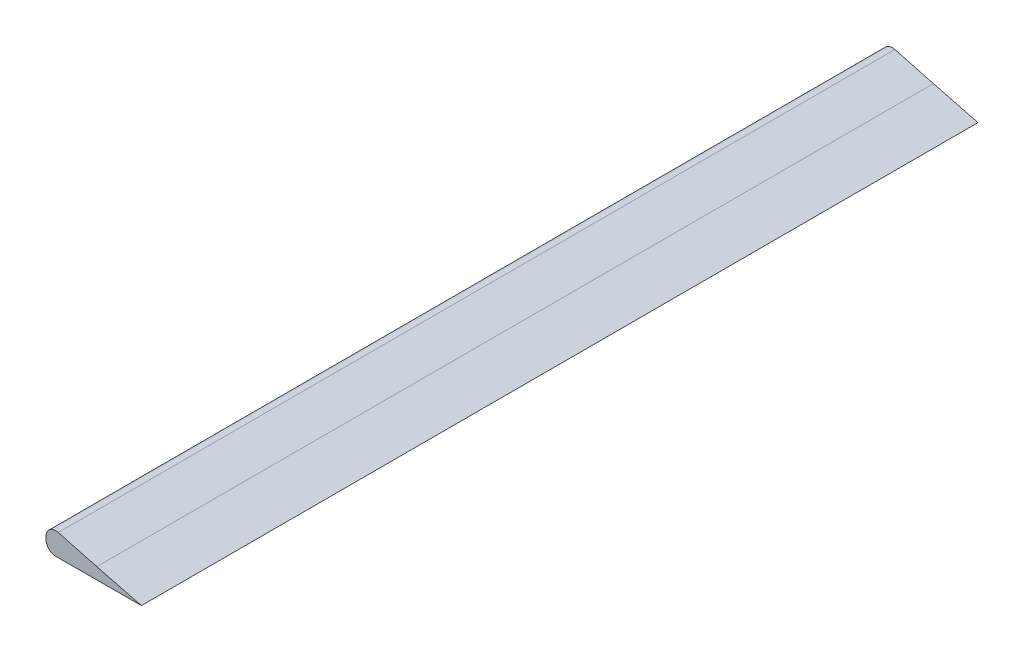
ISO-10303-21;
HEADER;
FILE_DESCRIPTION(('STEP AP214'),'2;1');
FILE_NAME('part.step','',(''),(''),'','','');
FILE_SCHEMA(('AUTOMOTIVE_DESIGN { 1 0 10303 214 1 1 1 1 }'));
ENDSEC;
DATA;
#1=APPLICATION_CONTEXT('core data for automotive mechanical design processes');
#2=APPLICATION_PROTOCOL_DEFINITION('international standard','automotive_design',2000,#1);
#3=PRODUCT_CONTEXT('',#1,'mechanical');
#4=PRODUCT('Part','Part','',(#3));
#5=PRODUCT_RELATED_PRODUCT_CATEGORY('part','',(#4));
#6=PRODUCT_DEFINITION_FORMATION('','',#4);
#7=PRODUCT_DEFINITION_CONTEXT('part definition',#1,'design');
#8=PRODUCT_DEFINITION('design','',#6,#7);
#9=PRODUCT_DEFINITION_SHAPE('','',#8);
#10=(LENGTH_UNIT() NAMED_UNIT(*) SI_UNIT(.MILLI.,.METRE.));
#11=(NAMED_UNIT(*) PLANE_ANGLE_UNIT() SI_UNIT($,.RADIAN.));
#12=(NAMED_UNIT(*) SI_UNIT($,.STERADIAN.) SOLID_ANGLE_UNIT());
#13=UNCERTAINTY_MEASURE_WITH_UNIT(LENGTH_MEASURE(1.E-05),#10,'distance_accuracy_value','');
#14=(GEOMETRIC_REPRESENTATION_CONTEXT(3) GLOBAL_UNCERTAINTY_ASSIGNED_CONTEXT((#13)) GLOBAL_UNIT_ASSIGNED_CONTEXT((#10,
#11,#12)) REPRESENTATION_CONTEXT('',''));
#15=CARTESIAN_POINT('',(0.,0.,0.));
#16=DIRECTION('',(0.,0.,1.));
#17=DIRECTION('',(1.,0.,0.));
#18=AXIS2_PLACEMENT_3D('',#15,#16,#17);
#19=CARTESIAN_POINT('',(-13.0014948619376,-2.02603168595216,297.));
#20=CARTESIAN_POINT('',(-8.33306977248559,-2.01777113945329,297.));
#21=CARTESIAN_POINT('',(-3.66462088859667,-2.00948317124924,297.));
#22=CARTESIAN_POINT('',(1.00380761090027,-2.00059537552152,297.));
#23=B_SPLINE_CURVE_WITH_KNOTS('',3,(#19,#20,#21,#22),.UNSPECIFIED.,.F.,.F.,(4,4),
(0.953389626926923,1.),.UNSPECIFIED.);
#24=DIRECTION('',(0.,0.,-1.));
#25=VECTOR('',#24,1.);
#26=SURFACE_OF_LINEAR_EXTRUSION('',#23,#25);
#27=CARTESIAN_POINT('',(-13.0014948619376,-2.02603168595216,236.));
#28=CARTESIAN_POINT('',(-8.33306977248559,-2.01777113945329,236.));
#29=CARTESIAN_POINT('',(-3.66462088859667,-2.00948317124924,236.));
#30=CARTESIAN_POINT('',(1.00380761090027,-2.00059537552152,236.));
#31=B_SPLINE_CURVE_WITH_KNOTS('',3,(#27,#28,#29,#30),.UNSPECIFIED.,.F.,.F.,(4,4),
(0.953389626926923,1.),.UNSPECIFIED.);
#32=CARTESIAN_POINT('',(-13.0014948619378,-2.02603168595216,236.));
#33=VERTEX_POINT('',#32);
#34=CARTESIAN_POINT('',(-4.50768792853542,-2.01084440429259,236.));
#35=VERTEX_POINT('',#34);
#36=EDGE_CURVE('E223',#33,#35,#31,.T.);
#37=ORIENTED_EDGE('',*,*,#36,.F.);
#38=DIRECTION('',(0.,0.,-1.));
#39=VECTOR('',#38,1.);
#40=CARTESIAN_POINT('',(-13.0014948619378,-2.02603168595216,297.));
#41=LINE('',#40,#39);
#42=CARTESIAN_POINT('',(-13.0014948619378,-2.02603168595216,61.0000000000006));
#43=VERTEX_POINT('',#42);
#44=EDGE_CURVE('E360',#33,#43,#41,.T.);
#45=ORIENTED_EDGE('',*,*,#44,.T.);
#46=CARTESIAN_POINT('',(-13.0014948619376,-2.02603168595216,61.0000000000006));
#47=CARTESIAN_POINT('',(-8.33306977248559,-2.01777113945329,61.0000000000006));
#48=CARTESIAN_POINT('',(-3.66462088859667,-2.00948317124924,61.0000000000006));
#49=CARTESIAN_POINT('',(1.00380761090027,-2.00059537552152,61.0000000000006));
#50=B_SPLINE_CURVE_WITH_KNOTS('',3,(#46,#47,#48,#49),.UNSPECIFIED.,.F.,.F.,(4,4),
(0.953389626926923,1.),.UNSPECIFIED.);
#51=CARTESIAN_POINT('',(-4.50768792853542,-2.01084440429259,61.0000000000006));
#52=VERTEX_POINT('',#51);
#53=EDGE_CURVE('E50',#52,#43,#50,.F.);
#54=ORIENTED_EDGE('',*,*,#53,.F.);
#55=DIRECTION('',(0.,0.,-1.));
#56=VECTOR('',#55,1.);
#57=CARTESIAN_POINT('',(-4.5076879285354,-2.01084440429259,297.));
#58=LINE('',#57,#56);
#59=CARTESIAN_POINT('',(-4.50768792853542,-2.01084440429259,49.0000000000005));
#60=VERTEX_POINT('',#59);
#61=EDGE_CURVE('E43',#60,#52,#58,.F.);
#62=ORIENTED_EDGE('',*,*,#61,.F.);
#63=CARTESIAN_POINT('',(-13.0014948619376,-2.02603168595216,49.0000000000005));
#64=CARTESIAN_POINT('',(-8.33306977248559,-2.01777113945329,49.0000000000005));
#65=CARTESIAN_POINT('',(-3.66462088859667,-2.00948317124924,49.0000000000005));
#66=CARTESIAN_POINT('',(1.00380761090027,-2.00059537552152,49.0000000000005));
#67=B_SPLINE_CURVE_WITH_KNOTS('',3,(#63,#64,#65,#66),.UNSPECIFIED.,.F.,.F.,(4,4),
(0.953389626926923,1.),.UNSPECIFIED.);
#68=CARTESIAN_POINT('',(-13.0014948619378,-2.02603168595216,49.0000000000005));
#69=VERTEX_POINT('',#68);
#70=EDGE_CURVE('E183',#69,#60,#67,.T.);
#71=ORIENTED_EDGE('',*,*,#70,.F.);
#72=CARTESIAN_POINT('',(-13.0014948619378,-2.02603168595216,0.));
#73=VERTEX_POINT('',#72);
#74=EDGE_CURVE('E355',#69,#73,#41,.T.);
#75=ORIENTED_EDGE('',*,*,#74,.T.);
#76=CARTESIAN_POINT('',(-13.0014948619376,-2.02603168595216,0.));
#77=CARTESIAN_POINT('',(-8.33306977248559,-2.01777113945329,0.));
#78=CARTESIAN_POINT('',(-3.66462088859667,-2.00948317124924,0.));
#79=CARTESIAN_POINT('',(1.00380761090027,-2.00059537552152,0.));
#80=B_SPLINE_CURVE_WITH_KNOTS('',3,(#76,#77,#78,#79),.UNSPECIFIED.,.F.,.F.,(4,4),
(0.953389626926923,1.),.UNSPECIFIED.);
#81=CARTESIAN_POINT('',(1.00380761090028,-2.00059537552152,0.));
#82=VERTEX_POINT('',#81);
#83=EDGE_CURVE('E229',#73,#82,#80,.T.);
#84=ORIENTED_EDGE('',*,*,#83,.T.);
#85=DIRECTION('',(0.,0.,-1.));
#86=VECTOR('',#85,1.);
#87=CARTESIAN_POINT('',(1.00380761090028,-2.00059537552152,297.));
#88=LINE('',#87,#86);
#89=CARTESIAN_POINT('',(1.00380761090028,-2.00059537552152,297.));
#90=VERTEX_POINT('',#89);
#91=EDGE_CURVE('E262',#90,#82,#88,.T.);
#92=ORIENTED_EDGE('',*,*,#91,.F.);
#93=CARTESIAN_POINT('',(1.00380761090027,-2.00059537552152,297.));
#94=CARTESIAN_POINT('',(-3.66462088859667,-2.00948317124924,297.));
#95=CARTESIAN_POINT('',(-8.33306977248559,-2.01777113945329,297.));
#96=CARTESIAN_POINT('',(-13.0014948619376,-2.02603168595216,297.));
#97=B_SPLINE_CURVE_WITH_KNOTS('',3,(#93,#94,#95,#96),.UNSPECIFIED.,.F.,.F.,(4,4),
(0.953389626926923,1.),.UNSPECIFIED.);
#98=CARTESIAN_POINT('',(-13.0014948619378,-2.02603168595216,297.));
#99=VERTEX_POINT('',#98);
#100=EDGE_CURVE('E259',#99,#90,#97,.F.);
#101=ORIENTED_EDGE('',*,*,#100,.F.);
#102=CARTESIAN_POINT('',(-13.0014948619378,-2.02603168595216,248.));
#103=VERTEX_POINT('',#102);
#104=EDGE_CURVE('E358',#99,#103,#41,.T.);
#105=ORIENTED_EDGE('',*,*,#104,.T.);
#106=CARTESIAN_POINT('',(-13.0014948619376,-2.02603168595216,248.));
#107=CARTESIAN_POINT('',(-8.33306977248559,-2.01777113945329,248.));
#108=CARTESIAN_POINT('',(-3.66462088859667,-2.00948317124924,248.));
#109=CARTESIAN_POINT('',(1.00380761090027,-2.00059537552152,248.));
#110=B_SPLINE_CURVE_WITH_KNOTS('',3,(#106,#107,#108,#109),.UNSPECIFIED.,.F.,.F.,(4,4),
(0.953389626926923,1.),.UNSPECIFIED.);
#111=CARTESIAN_POINT('',(-4.50768792853542,-2.01084440429259,248.));
#112=VERTEX_POINT('',#111);
#113=EDGE_CURVE('E58',#112,#103,#110,.F.);
#114=ORIENTED_EDGE('',*,*,#113,.F.);
#115=DIRECTION('',(0.,0.,-1.));
#116=VECTOR('',#115,1.);
#117=CARTESIAN_POINT('',(-4.5076879285354,-2.01084440429259,297.));
#118=LINE('',#117,#116);
#119=EDGE_CURVE('E11',#35,#112,#118,.F.);
#120=ORIENTED_EDGE('',*,*,#119,.F.);
#121=EDGE_LOOP('',(#37,#45,#54,#62,#71,#75,#84,#92,#101,#105,#114,#120));
#122=FACE_BOUND('',#121,.T.);
#123=ADVANCED_FACE('F34',(#122),#26,.F.);
#124=CARTESIAN_POINT('',(-16.5076879285355,2.36426520750804,297.));
#125=DIRECTION('',(1.,0.,0.));
#126=DIRECTION('',(0.,1.,0.));
#127=AXIS2_PLACEMENT_3D('',#124,#125,#126);
#128=PLANE('',#127);
#129=DIRECTION('',(0.,1.,0.));
#130=VECTOR('',#129,1.);
#131=CARTESIAN_POINT('',(-16.5076879285354,-2.02653168595243,236.));
#132=LINE('',#131,#130);
#133=CARTESIAN_POINT('',(-16.5076879285355,1.47396283489011,236.));
#134=VERTEX_POINT('',#133);
#135=CARTESIAN_POINT('',(-16.5076879285355,1.91911402119909,236.));
#136=VERTEX_POINT('',#135);
#137=EDGE_CURVE('E158',#134,#136,#132,.T.);
#138=ORIENTED_EDGE('',*,*,#137,.T.);
#139=DIRECTION('',(0.,0.,-1.));
#140=VECTOR('',#139,1.);
#141=CARTESIAN_POINT('',(-16.5076879285355,1.91911402119909,236.));
#142=LINE('',#141,#140);
#143=CARTESIAN_POINT('',(-16.5076879285355,1.91911402119909,248.));
#144=VERTEX_POINT('',#143);
#145=EDGE_CURVE('E166',#144,#136,#142,.T.);
#146=ORIENTED_EDGE('',*,*,#145,.F.);
#147=DIRECTION('',(0.,1.,0.));
#148=VECTOR('',#147,1.);
#149=CARTESIAN_POINT('',(-16.5076879285354,-2.02653168595243,248.));
#150=LINE('',#149,#148);
#151=CARTESIAN_POINT('',(-16.5076879285355,1.47396283489011,248.));
#152=VERTEX_POINT('',#151);
#153=EDGE_CURVE('E478',#152,#144,#150,.T.);
#154=ORIENTED_EDGE('',*,*,#153,.F.);
#155=DIRECTION('',(0.,0.,-1.));
#156=VECTOR('',#155,1.);
#157=CARTESIAN_POINT('',(-16.5076879285355,1.47396283489014,297.));
#158=LINE('',#157,#156);
#159=CARTESIAN_POINT('',(-16.5076879285355,1.47396283489014,297.));
#160=VERTEX_POINT('',#159);
#161=EDGE_CURVE('E363',#160,#152,#158,.T.);
#162=ORIENTED_EDGE('',*,*,#161,.F.);
#163=DIRECTION('',(0.,-1.,0.));
#164=VECTOR('',#163,1.);
#165=CARTESIAN_POINT('',(-16.5076879285355,2.36426520750804,297.));
#166=LINE('',#165,#164);
#167=CARTESIAN_POINT('',(-16.5076879285355,2.36426520750804,297.));
#168=VERTEX_POINT('',#167);
#169=EDGE_CURVE('E356',#168,#160,#166,.T.);
#170=ORIENTED_EDGE('',*,*,#169,.F.);
#171=DIRECTION('',(0.,0.,-1.));
#172=VECTOR('',#171,1.);
#173=CARTESIAN_POINT('',(-16.5076879285355,2.36426520750804,297.));
#174=LINE('',#173,#172);
#175=CARTESIAN_POINT('',(-16.5076879285355,2.36426520750804,0.));
#176=VERTEX_POINT('',#175);
#177=EDGE_CURVE('E437',#168,#176,#174,.T.);
#178=ORIENTED_EDGE('',*,*,#177,.T.);
#179=DIRECTION('',(0.,-1.,0.));
#180=VECTOR('',#179,1.);
#181=CARTESIAN_POINT('',(-16.5076879285355,2.36426520750804,0.));
#182=LINE('',#181,#180);
#183=CARTESIAN_POINT('',(-16.5076879285355,1.47396283489014,0.));
#184=VERTEX_POINT('',#183);
#185=EDGE_CURVE('E328',#176,#184,#182,.T.);
#186=ORIENTED_EDGE('',*,*,#185,.T.);
#187=CARTESIAN_POINT('',(-16.5076879285355,1.47396283489011,49.0000000000005));
#188=VERTEX_POINT('',#187);
#189=EDGE_CURVE('E359',#188,#184,#158,.T.);
#190=ORIENTED_EDGE('',*,*,#189,.F.);
#191=DIRECTION('',(0.,1.,0.));
#192=VECTOR('',#191,1.);
#193=CARTESIAN_POINT('',(-16.5076879285354,-2.02653168595245,49.0000000000005));
#194=LINE('',#193,#192);
#195=CARTESIAN_POINT('',(-16.5076879285355,1.91911402119907,49.0000000000005));
#196=VERTEX_POINT('',#195);
#197=EDGE_CURVE('E175',#188,#196,#194,.T.);
#198=ORIENTED_EDGE('',*,*,#197,.T.);
#199=DIRECTION('',(0.,0.,-1.));
#200=VECTOR('',#199,1.);
#201=CARTESIAN_POINT('',(-16.5076879285355,1.91911402119907,49.0000000000005));
#202=LINE('',#201,#200);
#203=CARTESIAN_POINT('',(-16.5076879285355,1.91911402119907,61.0000000000006));
#204=VERTEX_POINT('',#203);
#205=EDGE_CURVE('E189',#204,#196,#202,.T.);
#206=ORIENTED_EDGE('',*,*,#205,.F.);
#207=DIRECTION('',(0.,1.,0.));
#208=VECTOR('',#207,1.);
#209=CARTESIAN_POINT('',(-16.5076879285354,-2.02653168595245,61.0000000000006));
#210=LINE('',#209,#208);
#211=CARTESIAN_POINT('',(-16.5076879285355,1.47396283489011,61.0000000000006));
#212=VERTEX_POINT('',#211);
#213=EDGE_CURVE('E201',#212,#204,#210,.T.);
#214=ORIENTED_EDGE('',*,*,#213,.F.);
#215=EDGE_CURVE('E181',#134,#212,#158,.T.);
#216=ORIENTED_EDGE('',*,*,#215,.F.);
#217=EDGE_LOOP('',(#138,#146,#154,#162,#170,#178,#186,#190,#198,#206,#214,#216));
#218=FACE_BOUND('',#217,.T.);
#219=ADVANCED_FACE('F178',(#218),#128,.F.);
#220=CARTESIAN_POINT('',(-13.0076879285355,1.47396283489014,297.));
#221=DIRECTION('',(0.,0.,-1.));
#222=DIRECTION('',(-1.,0.,0.));
#223=AXIS2_PLACEMENT_3D('',#220,#221,#222);
#224=CYLINDRICAL_SURFACE('',#223,3.5);
#225=CARTESIAN_POINT('',(-13.0076879285355,1.47396283489014,236.));
#226=DIRECTION('',(0.,0.,1.));
#227=DIRECTION('',(0.,-1.,0.));
#228=AXIS2_PLACEMENT_3D('',#225,#226,#227);
#229=CIRCLE('',#228,3.5);
#230=EDGE_CURVE('E380',#134,#33,#229,.T.);
#231=ORIENTED_EDGE('',*,*,#230,.F.);
#232=ORIENTED_EDGE('',*,*,#215,.T.);
#233=CARTESIAN_POINT('',(-13.0076879285355,1.47396283489014,61.0000000000006));
#234=DIRECTION('',(0.,0.,-1.));
#235=DIRECTION('',(0.,1.,0.));
#236=AXIS2_PLACEMENT_3D('',#233,#234,#235);
#237=CIRCLE('',#236,3.5);
#238=EDGE_CURVE('E265',#43,#212,#237,.T.);
#239=ORIENTED_EDGE('',*,*,#238,.F.);
#240=ORIENTED_EDGE('',*,*,#44,.F.);
#241=EDGE_LOOP('',(#231,#232,#239,#240));
#242=FACE_BOUND('',#241,.T.);
#243=ADVANCED_FACE('F305',(#242),#224,.T.);
#244=CARTESIAN_POINT('',(-13.0076879285355,1.47396283489014,248.));
#245=DIRECTION('',(0.,0.,-1.));
#246=DIRECTION('',(0.,1.,0.));
#247=AXIS2_PLACEMENT_3D('',#244,#245,#246);
#248=CIRCLE('',#247,3.5);
#249=EDGE_CURVE('E378',#103,#152,#248,.T.);
#250=ORIENTED_EDGE('',*,*,#249,.F.);
#251=ORIENTED_EDGE('',*,*,#104,.F.);
#252=CARTESIAN_POINT('',(-13.0076879285355,1.47396283489014,297.));
#253=DIRECTION('',(0.,0.,1.));
#254=DIRECTION('',(-1.,0.,0.));
#255=AXIS2_PLACEMENT_3D('',#252,#253,#254);
#256=CIRCLE('',#255,3.5);
#257=EDGE_CURVE('E348',#160,#99,#256,.T.);
#258=ORIENTED_EDGE('',*,*,#257,.F.);
#259=ORIENTED_EDGE('',*,*,#161,.T.);
#260=EDGE_LOOP('',(#250,#251,#258,#259));
#261=FACE_BOUND('',#260,.T.);
#262=ADVANCED_FACE('F396',(#261),#224,.T.);
#263=CARTESIAN_POINT('',(-13.0076879285355,1.47396283489014,49.0000000000005));
#264=DIRECTION('',(0.,0.,1.));
#265=DIRECTION('',(0.,-1.,0.));
#266=AXIS2_PLACEMENT_3D('',#263,#264,#265);
#267=CIRCLE('',#266,3.5);
#268=EDGE_CURVE('E376',#188,#69,#267,.T.);
#269=ORIENTED_EDGE('',*,*,#268,.F.);
#270=ORIENTED_EDGE('',*,*,#189,.T.);
#271=CARTESIAN_POINT('',(-13.0076879285355,1.47396283489014,0.));
#272=DIRECTION('',(0.,0.,1.));
#273=DIRECTION('',(-1.,0.,0.));
#274=AXIS2_PLACEMENT_3D('',#271,#272,#273);
#275=CIRCLE('',#274,3.5);
#276=EDGE_CURVE('E289',#184,#73,#275,.T.);
#277=ORIENTED_EDGE('',*,*,#276,.T.);
#278=ORIENTED_EDGE('',*,*,#74,.F.);
#279=EDGE_LOOP('',(#269,#270,#277,#278));
#280=FACE_BOUND('',#279,.T.);
#281=ADVANCED_FACE('F398',(#280),#224,.T.);
#282=CARTESIAN_POINT('',(1.00380761090028,-2.00059537552152,297.));
#283=CARTESIAN_POINT('',(6.45531953314277,-1.99021673860396,297.));
#284=CARTESIAN_POINT('',(11.9068036588753,-1.97902016648547,297.));
#285=CARTESIAN_POINT('',(17.3581896399021,-1.96609418827521,297.));
#286=B_SPLINE_CURVE_WITH_KNOTS('',3,(#282,#283,#284,#285),.UNSPECIFIED.,.F.,.F.,(4,4),(1.,
1.05442880929534),.UNSPECIFIED.);
#287=DIRECTION('',(0.,0.,-1.));
#288=VECTOR('',#287,1.);
#289=SURFACE_OF_LINEAR_EXTRUSION('',#286,#288);
#290=CARTESIAN_POINT('',(1.00380761090028,-2.00059537552152,0.));
#291=CARTESIAN_POINT('',(6.45531953314277,-1.99021673860396,0.));
#292=CARTESIAN_POINT('',(11.9068036588753,-1.97902016648547,0.));
#293=CARTESIAN_POINT('',(17.3581896399021,-1.96609418827521,0.));
#294=B_SPLINE_CURVE_WITH_KNOTS('',3,(#290,#291,#292,#293),.UNSPECIFIED.,.F.,.F.,(4,4),(1.,
1.05442880929534),.UNSPECIFIED.);
#295=CARTESIAN_POINT('',(17.358189639902,-1.96609418827521,0.));
#296=VERTEX_POINT('',#295);
#297=EDGE_CURVE('E323',#82,#296,#294,.T.);
#298=ORIENTED_EDGE('',*,*,#297,.T.);
#299=DIRECTION('',(0.,0.,-1.));
#300=VECTOR('',#299,1.);
#301=CARTESIAN_POINT('',(17.358189639902,-1.96609418827521,297.));
#302=LINE('',#301,#300);
#303=CARTESIAN_POINT('',(17.358189639902,-1.96609418827521,297.));
#304=VERTEX_POINT('',#303);
#305=EDGE_CURVE('E266',#304,#296,#302,.T.);
#306=ORIENTED_EDGE('',*,*,#305,.F.);
#307=EDGE_CURVE('E255',#90,#304,#286,.T.);
#308=ORIENTED_EDGE('',*,*,#307,.F.);
#309=ORIENTED_EDGE('',*,*,#91,.T.);
#310=EDGE_LOOP('',(#298,#306,#308,#309));
#311=FACE_BOUND('',#310,.T.);
#312=ADVANCED_FACE('F252',(#311),#289,.F.);
#313=CARTESIAN_POINT('',(17.358189639902,-1.96609418827521,297.));
#314=DIRECTION('',(-0.24912608886899,-0.968471058857641,0.));
#315=DIRECTION('',(0.968471058857641,-0.24912608886899,0.));
#316=AXIS2_PLACEMENT_3D('',#313,#314,#315);
#317=PLANE('',#316);
#318=DIRECTION('',(-0.968471058857641,0.24912608886899,0.));
#319=VECTOR('',#318,1.);
#320=CARTESIAN_POINT('',(17.358189639902,-1.96609418827521,0.));
#321=LINE('',#320,#319);
#322=CARTESIAN_POINT('',(1.53521577750087,2.10415195544119,0.));
#323=VERTEX_POINT('',#322);
#324=EDGE_CURVE('E315',#296,#323,#321,.T.);
#325=ORIENTED_EDGE('',*,*,#324,.T.);
#326=DIRECTION('',(0.,0.,-1.));
#327=VECTOR('',#326,1.);
#328=CARTESIAN_POINT('',(1.53521577750087,2.10415195544119,297.));
#329=LINE('',#328,#327);
#330=CARTESIAN_POINT('',(1.53521577750087,2.10415195544119,297.));
#331=VERTEX_POINT('',#330);
#332=EDGE_CURVE('E436',#331,#323,#329,.T.);
#333=ORIENTED_EDGE('',*,*,#332,.F.);
#334=DIRECTION('',(-0.968471058857641,0.24912608886899,0.));
#335=VECTOR('',#334,1.);
#336=CARTESIAN_POINT('',(17.358189639902,-1.96609418827521,297.));
#337=LINE('',#336,#335);
#338=EDGE_CURVE('E258',#304,#331,#337,.T.);
#339=ORIENTED_EDGE('',*,*,#338,.F.);
#340=ORIENTED_EDGE('',*,*,#305,.T.);
#341=EDGE_LOOP('',(#325,#333,#339,#340));
#342=FACE_BOUND('',#341,.T.);
#343=ADVANCED_FACE('F407',(#342),#317,.F.);
#344=CARTESIAN_POINT('',(1.53521577750087,2.10415195544119,297.));
#345=CARTESIAN_POINT('',(-1.48950566222893,2.93385347851144,297.));
#346=CARTESIAN_POINT('',(-6.03764057675755,4.17726407861087,297.));
#347=CARTESIAN_POINT('',(-10.608291509946,5.3639923790538,297.));
#348=CARTESIAN_POINT('',(-12.1419735295253,5.75550960733336,297.));
#349=B_SPLINE_CURVE_WITH_KNOTS('',3,(#344,#345,#346,#347,#348),.UNSPECIFIED.,.F.,.F.,(4,1,4),
(0.,0.03125,0.0470008599416978),.UNSPECIFIED.);
#350=DIRECTION('',(0.,0.,-1.));
#351=VECTOR('',#350,1.);
#352=SURFACE_OF_LINEAR_EXTRUSION('',#349,#351);
#353=CARTESIAN_POINT('',(1.53521577750087,2.10415195544119,0.));
#354=CARTESIAN_POINT('',(-1.48950566222893,2.93385347851144,0.));
#355=CARTESIAN_POINT('',(-6.03764057675755,4.17726407861087,0.));
#356=CARTESIAN_POINT('',(-10.608291509946,5.3639923790538,0.));
#357=CARTESIAN_POINT('',(-12.1419735295253,5.75550960733336,0.));
#358=B_SPLINE_CURVE_WITH_KNOTS('',3,(#353,#354,#355,#356,#357),.UNSPECIFIED.,.F.,.F.,(4,1,4),
(0.,0.03125,0.0470008599416978),.UNSPECIFIED.);
#359=CARTESIAN_POINT('',(-12.1419735295253,5.75550960733337,0.));
#360=VERTEX_POINT('',#359);
#361=EDGE_CURVE('E322',#323,#360,#358,.T.);
#362=ORIENTED_EDGE('',*,*,#361,.T.);
#363=DIRECTION('',(0.,0.,-1.));
#364=VECTOR('',#363,1.);
#365=CARTESIAN_POINT('',(-12.1419735295253,5.75550960733337,297.));
#366=LINE('',#365,#364);
#367=CARTESIAN_POINT('',(-12.1419735295253,5.75550960733337,297.));
#368=VERTEX_POINT('',#367);
#369=EDGE_CURVE('E434',#368,#360,#366,.T.);
#370=ORIENTED_EDGE('',*,*,#369,.F.);
#371=CARTESIAN_POINT('',(-12.1419735295253,5.75550960733336,297.));
#372=CARTESIAN_POINT('',(-10.608291509946,5.3639923790538,297.));
#373=CARTESIAN_POINT('',(-6.03764057675755,4.17726407861087,297.));
#374=CARTESIAN_POINT('',(-1.48950566222893,2.93385347851144,297.));
#375=CARTESIAN_POINT('',(1.53521577750087,2.10415195544119,297.));
#376=B_SPLINE_CURVE_WITH_KNOTS('',3,(#371,#372,#373,#374,#375),.UNSPECIFIED.,.F.,.F.,(4,1,4),
(0.,0.0157508599416978,0.0470008599416978),.UNSPECIFIED.);
#377=EDGE_CURVE('E431',#331,#368,#376,.F.);
#378=ORIENTED_EDGE('',*,*,#377,.F.);
#379=ORIENTED_EDGE('',*,*,#332,.T.);
#380=EDGE_LOOP('',(#362,#370,#378,#379));
#381=FACE_BOUND('',#380,.T.);
#382=ADVANCED_FACE('F403',(#381),#352,.F.);
#383=CARTESIAN_POINT('',(-13.0076879285355,2.36426520750805,297.));
#384=DIRECTION('',(0.,0.,-1.));
#385=DIRECTION('',(-1.,0.,0.));
#386=AXIS2_PLACEMENT_3D('',#383,#384,#385);
#387=CYLINDRICAL_SURFACE('',#386,3.5);
#388=CARTESIAN_POINT('',(-13.0076879285355,2.36426520750805,0.));
#389=DIRECTION('',(0.,0.,1.));
#390=DIRECTION('',(1.,0.,0.));
#391=AXIS2_PLACEMENT_3D('',#388,#389,#390);
#392=CIRCLE('',#391,3.5);
#393=EDGE_CURVE('E326',#360,#176,#392,.T.);
#394=ORIENTED_EDGE('',*,*,#393,.T.);
#395=ORIENTED_EDGE('',*,*,#177,.F.);
#396=CARTESIAN_POINT('',(-13.0076879285355,2.36426520750805,297.));
#397=DIRECTION('',(0.,0.,1.));
#398=DIRECTION('',(1.,0.,0.));
#399=AXIS2_PLACEMENT_3D('',#396,#397,#398);
#400=CIRCLE('',#399,3.5);
#401=EDGE_CURVE('E429',#368,#168,#400,.T.);
#402=ORIENTED_EDGE('',*,*,#401,.F.);
#403=ORIENTED_EDGE('',*,*,#369,.T.);
#404=EDGE_LOOP('',(#394,#395,#402,#403));
#405=FACE_BOUND('',#404,.T.);
#406=ADVANCED_FACE('F400',(#405),#387,.T.);
#407=CARTESIAN_POINT('',(-5.99884490428551,-2.01354874919766,297.));
#408=DIRECTION('',(0.,0.,-1.));
#409=DIRECTION('',(-1.,0.,0.));
#410=AXIS2_PLACEMENT_3D('',#407,#408,#409);
#411=PLANE('',#410);
#412=ORIENTED_EDGE('',*,*,#100,.T.);
#413=ORIENTED_EDGE('',*,*,#307,.T.);
#414=ORIENTED_EDGE('',*,*,#338,.T.);
#415=ORIENTED_EDGE('',*,*,#377,.T.);
#416=ORIENTED_EDGE('',*,*,#401,.T.);
#417=ORIENTED_EDGE('',*,*,#169,.T.);
#418=ORIENTED_EDGE('',*,*,#257,.T.);
#419=EDGE_LOOP('',(#412,#413,#414,#415,#416,#417,#418));
#420=FACE_BOUND('',#419,.T.);
#421=ADVANCED_FACE('F302',(#420),#411,.F.);
#422=CARTESIAN_POINT('',(-5.99884490428551,-2.01354874919766,0.));
#423=DIRECTION('',(0.,0.,-1.));
#424=DIRECTION('',(-1.,0.,0.));
#425=AXIS2_PLACEMENT_3D('',#422,#423,#424);
#426=PLANE('',#425);
#427=ORIENTED_EDGE('',*,*,#83,.F.);
#428=ORIENTED_EDGE('',*,*,#276,.F.);
#429=ORIENTED_EDGE('',*,*,#185,.F.);
#430=ORIENTED_EDGE('',*,*,#393,.F.);
#431=ORIENTED_EDGE('',*,*,#361,.F.);
#432=ORIENTED_EDGE('',*,*,#324,.F.);
#433=ORIENTED_EDGE('',*,*,#297,.F.);
#434=EDGE_LOOP('',(#427,#428,#429,#430,#431,#432,#433));
#435=FACE_BOUND('',#434,.T.);
#436=ADVANCED_FACE('F291',(#435),#426,.T.);
#437=CARTESIAN_POINT('',(-4.50768792853542,-2.02653168595236,49.0000000000005));
#438=DIRECTION('',(-1.,0.,0.));
#439=DIRECTION('',(0.,-1.,0.));
#440=AXIS2_PLACEMENT_3D('',#437,#438,#439);
#441=PLANE('',#440);
#442=ORIENTED_EDGE('',*,*,#61,.T.);
#443=DIRECTION('',(0.,1.,0.));
#444=VECTOR('',#443,1.);
#445=CARTESIAN_POINT('',(-4.50768792853542,-2.02653168595236,61.0000000000006));
#446=LINE('',#445,#444);
#447=CARTESIAN_POINT('',(-4.50768792853545,1.91911402119916,61.0000000000006));
#448=VERTEX_POINT('',#447);
#449=EDGE_CURVE('E203',#52,#448,#446,.T.);
#450=ORIENTED_EDGE('',*,*,#449,.T.);
#451=DIRECTION('',(0.,0.,1.));
#452=VECTOR('',#451,1.);
#453=CARTESIAN_POINT('',(-4.50768792853545,1.91911402119916,49.0000000000005));
#454=LINE('',#453,#452);
#455=CARTESIAN_POINT('',(-4.50768792853545,1.91911402119916,49.0000000000005));
#456=VERTEX_POINT('',#455);
#457=EDGE_CURVE('E195',#456,#448,#454,.T.);
#458=ORIENTED_EDGE('',*,*,#457,.F.);
#459=DIRECTION('',(0.,1.,0.));
#460=VECTOR('',#459,1.);
#461=CARTESIAN_POINT('',(-4.50768792853542,-2.02653168595236,49.0000000000005));
#462=LINE('',#461,#460);
#463=EDGE_CURVE('E205',#60,#456,#462,.T.);
#464=ORIENTED_EDGE('',*,*,#463,.F.);
#465=EDGE_LOOP('',(#442,#450,#458,#464));
#466=FACE_BOUND('',#465,.T.);
#467=ADVANCED_FACE('F301',(#466),#441,.T.);
#468=CARTESIAN_POINT('',(-16.5076879285354,-2.02653168595245,49.0000000000005));
#469=DIRECTION('',(0.,0.,1.));
#470=DIRECTION('',(0.,-1.,0.));
#471=AXIS2_PLACEMENT_3D('',#468,#469,#470);
#472=PLANE('',#471);
#473=ORIENTED_EDGE('',*,*,#70,.T.);
#474=ORIENTED_EDGE('',*,*,#463,.T.);
#475=DIRECTION('',(1.,0.,0.));
#476=VECTOR('',#475,1.);
#477=CARTESIAN_POINT('',(-16.5076879285355,1.91911402119907,49.0000000000005));
#478=LINE('',#477,#476);
#479=EDGE_CURVE('E192',#196,#456,#478,.T.);
#480=ORIENTED_EDGE('',*,*,#479,.F.);
#481=ORIENTED_EDGE('',*,*,#197,.F.);
#482=ORIENTED_EDGE('',*,*,#268,.T.);
#483=EDGE_LOOP('',(#473,#474,#480,#481,#482));
#484=FACE_BOUND('',#483,.T.);
#485=ADVANCED_FACE('F472',(#484),#472,.T.);
#486=CARTESIAN_POINT('',(-16.5076879285354,-2.02653168595245,61.0000000000006));
#487=DIRECTION('',(0.,0.,-1.));
#488=DIRECTION('',(0.,1.,0.));
#489=AXIS2_PLACEMENT_3D('',#486,#487,#488);
#490=PLANE('',#489);
#491=ORIENTED_EDGE('',*,*,#53,.T.);
#492=ORIENTED_EDGE('',*,*,#238,.T.);
#493=ORIENTED_EDGE('',*,*,#213,.T.);
#494=DIRECTION('',(-1.,0.,0.));
#495=VECTOR('',#494,1.);
#496=CARTESIAN_POINT('',(-16.5076879285355,1.91911402119907,61.0000000000006));
#497=LINE('',#496,#495);
#498=EDGE_CURVE('E198',#448,#204,#497,.T.);
#499=ORIENTED_EDGE('',*,*,#498,.F.);
#500=ORIENTED_EDGE('',*,*,#449,.F.);
#501=EDGE_LOOP('',(#491,#492,#493,#499,#500));
#502=FACE_BOUND('',#501,.T.);
#503=ADVANCED_FACE('F387',(#502),#490,.T.);
#504=CARTESIAN_POINT('',(0.,1.91911402119919,0.));
#505=DIRECTION('',(0.,1.,0.));
#506=DIRECTION('',(-1.,0.,0.));
#507=AXIS2_PLACEMENT_3D('',#504,#505,#506);
#508=PLANE('',#507);
#509=ORIENTED_EDGE('',*,*,#205,.T.);
#510=ORIENTED_EDGE('',*,*,#479,.T.);
#511=ORIENTED_EDGE('',*,*,#457,.T.);
#512=ORIENTED_EDGE('',*,*,#498,.T.);
#513=EDGE_LOOP('',(#509,#510,#511,#512));
#514=FACE_BOUND('',#513,.T.);
#515=ADVANCED_FACE('F474',(#514),#508,.F.);
#516=CARTESIAN_POINT('',(-4.50768792853542,-2.02653168595234,236.));
#517=DIRECTION('',(-1.,0.,0.));
#518=DIRECTION('',(0.,-1.,0.));
#519=AXIS2_PLACEMENT_3D('',#516,#517,#518);
#520=PLANE('',#519);
#521=ORIENTED_EDGE('',*,*,#119,.T.);
#522=DIRECTION('',(0.,1.,0.));
#523=VECTOR('',#522,1.);
#524=CARTESIAN_POINT('',(-4.50768792853542,-2.02653168595234,248.));
#525=LINE('',#524,#523);
#526=CARTESIAN_POINT('',(-4.50768792853545,1.91911402119919,248.));
#527=VERTEX_POINT('',#526);
#528=EDGE_CURVE('E185',#112,#527,#525,.T.);
#529=ORIENTED_EDGE('',*,*,#528,.T.);
#530=DIRECTION('',(0.,0.,1.));
#531=VECTOR('',#530,1.);
#532=CARTESIAN_POINT('',(-4.50768792853545,1.91911402119919,236.));
#533=LINE('',#532,#531);
#534=CARTESIAN_POINT('',(-4.50768792853545,1.91911402119919,236.));
#535=VERTEX_POINT('',#534);
#536=EDGE_CURVE('E165',#535,#527,#533,.T.);
#537=ORIENTED_EDGE('',*,*,#536,.F.);
#538=DIRECTION('',(0.,1.,0.));
#539=VECTOR('',#538,1.);
#540=CARTESIAN_POINT('',(-4.50768792853542,-2.02653168595234,236.));
#541=LINE('',#540,#539);
#542=EDGE_CURVE('E161',#35,#535,#541,.T.);
#543=ORIENTED_EDGE('',*,*,#542,.F.);
#544=EDGE_LOOP('',(#521,#529,#537,#543));
#545=FACE_BOUND('',#544,.T.);
#546=ADVANCED_FACE('F476',(#545),#520,.T.);
#547=CARTESIAN_POINT('',(-16.5076879285354,-2.02653168595243,236.));
#548=DIRECTION('',(0.,0.,1.));
#549=DIRECTION('',(0.,-1.,0.));
#550=AXIS2_PLACEMENT_3D('',#547,#548,#549);
#551=PLANE('',#550);
#552=ORIENTED_EDGE('',*,*,#36,.T.);
#553=ORIENTED_EDGE('',*,*,#542,.T.);
#554=DIRECTION('',(1.,0.,0.));
#555=VECTOR('',#554,1.);
#556=CARTESIAN_POINT('',(-16.5076879285355,1.91911402119909,236.));
#557=LINE('',#556,#555);
#558=EDGE_CURVE('E154',#136,#535,#557,.T.);
#559=ORIENTED_EDGE('',*,*,#558,.F.);
#560=ORIENTED_EDGE('',*,*,#137,.F.);
#561=ORIENTED_EDGE('',*,*,#230,.T.);
#562=EDGE_LOOP('',(#552,#553,#559,#560,#561));
#563=FACE_BOUND('',#562,.T.);
#564=ADVANCED_FACE('F156',(#563),#551,.T.);
#565=CARTESIAN_POINT('',(-16.5076879285354,-2.02653168595243,248.));
#566=DIRECTION('',(0.,0.,-1.));
#567=DIRECTION('',(0.,1.,0.));
#568=AXIS2_PLACEMENT_3D('',#565,#566,#567);
#569=PLANE('',#568);
#570=ORIENTED_EDGE('',*,*,#113,.T.);
#571=ORIENTED_EDGE('',*,*,#249,.T.);
#572=ORIENTED_EDGE('',*,*,#153,.T.);
#573=DIRECTION('',(-1.,0.,0.));
#574=VECTOR('',#573,1.);
#575=CARTESIAN_POINT('',(-16.5076879285355,1.91911402119909,248.));
#576=LINE('',#575,#574);
#577=EDGE_CURVE('E172',#527,#144,#576,.T.);
#578=ORIENTED_EDGE('',*,*,#577,.F.);
#579=ORIENTED_EDGE('',*,*,#528,.F.);
#580=EDGE_LOOP('',(#570,#571,#572,#578,#579));
#581=FACE_BOUND('',#580,.T.);
#582=ADVANCED_FACE('F481',(#581),#569,.T.);
#583=CARTESIAN_POINT('',(0.,1.91911402119919,0.));
#584=DIRECTION('',(0.,1.,0.));
#585=DIRECTION('',(-1.,0.,0.));
#586=AXIS2_PLACEMENT_3D('',#583,#584,#585);
#587=PLANE('',#586);
#588=ORIENTED_EDGE('',*,*,#145,.T.);
#589=ORIENTED_EDGE('',*,*,#558,.T.);
#590=ORIENTED_EDGE('',*,*,#536,.T.);
#591=ORIENTED_EDGE('',*,*,#577,.T.);
#592=EDGE_LOOP('',(#588,#589,#590,#591));
#593=FACE_BOUND('',#592,.T.);
#594=ADVANCED_FACE('F170',(#593),#587,.F.);
#595=CLOSED_SHELL('',(#123,#219,#243,#262,#281,#312,#343,#382,#406,#421,#436,#467,#485,#503,
#515,#546,#564,#582,#594));
#596=MANIFOLD_SOLID_BREP('B2',#595);
#597=ADVANCED_BREP_SHAPE_REPRESENTATION('',(#18,#596),#14);
#598=SHAPE_DEFINITION_REPRESENTATION(#9,#597);
ENDSEC;
END-ISO-10303-21;
